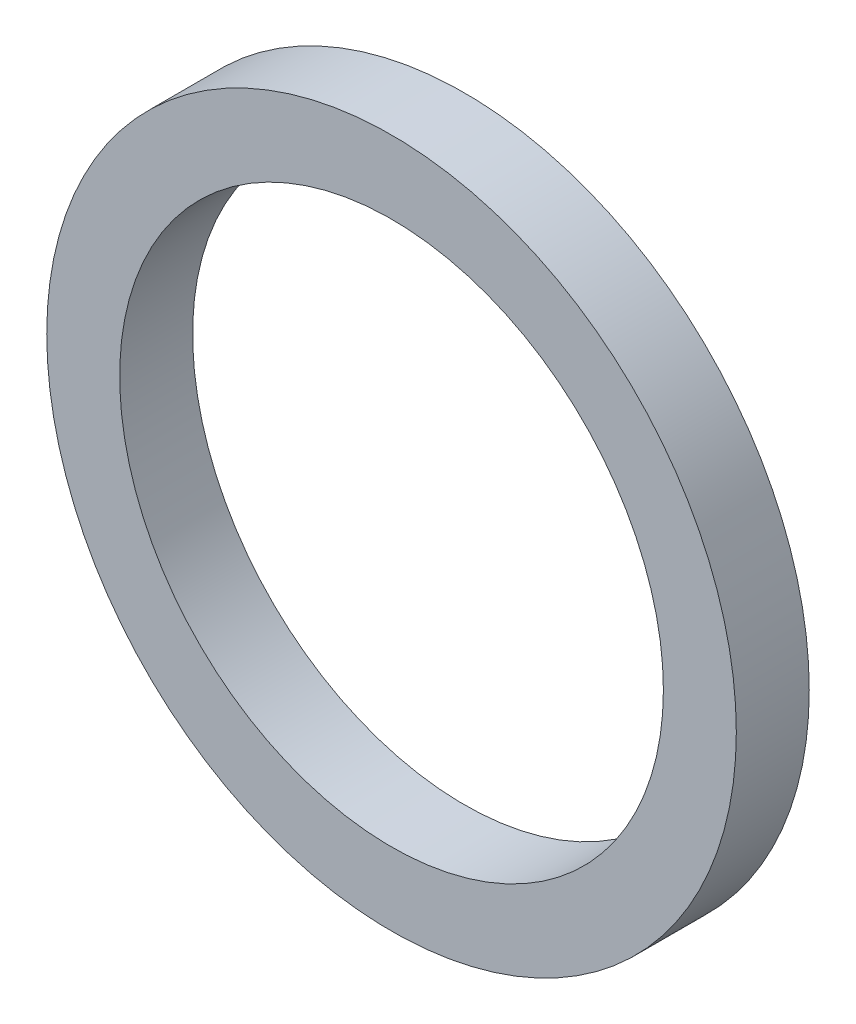
ISO-10303-21;
HEADER;
FILE_DESCRIPTION(('STEP AP214'),'2;1');
FILE_NAME('part.step','',(''),(''),'','','');
FILE_SCHEMA(('AUTOMOTIVE_DESIGN { 1 0 10303 214 1 1 1 1 }'));
ENDSEC;
DATA;
#1=APPLICATION_CONTEXT('core data for automotive mechanical design processes');
#2=APPLICATION_PROTOCOL_DEFINITION('international standard','automotive_design',2000,#1);
#3=PRODUCT_CONTEXT('',#1,'mechanical');
#4=PRODUCT('Part','Part','',(#3));
#5=PRODUCT_RELATED_PRODUCT_CATEGORY('part','',(#4));
#6=PRODUCT_DEFINITION_FORMATION('','',#4);
#7=PRODUCT_DEFINITION_CONTEXT('part definition',#1,'design');
#8=PRODUCT_DEFINITION('design','',#6,#7);
#9=PRODUCT_DEFINITION_SHAPE('','',#8);
#10=(LENGTH_UNIT() NAMED_UNIT(*) SI_UNIT(.MILLI.,.METRE.));
#11=(NAMED_UNIT(*) PLANE_ANGLE_UNIT() SI_UNIT($,.RADIAN.));
#12=(NAMED_UNIT(*) SI_UNIT($,.STERADIAN.) SOLID_ANGLE_UNIT());
#13=UNCERTAINTY_MEASURE_WITH_UNIT(LENGTH_MEASURE(1.E-05),#10,'distance_accuracy_value','');
#14=(GEOMETRIC_REPRESENTATION_CONTEXT(3) GLOBAL_UNCERTAINTY_ASSIGNED_CONTEXT((#13)) GLOBAL_UNIT_ASSIGNED_CONTEXT((#10,
#11,#12)) REPRESENTATION_CONTEXT('',''));
#15=CARTESIAN_POINT('',(0.,0.,0.));
#16=DIRECTION('',(0.,0.,1.));
#17=DIRECTION('',(1.,0.,0.));
#18=AXIS2_PLACEMENT_3D('',#15,#16,#17);
#19=CARTESIAN_POINT('',(0.,0.,1.1));
#20=DIRECTION('',(0.,0.,1.));
#21=DIRECTION('',(1.,0.,0.));
#22=AXIS2_PLACEMENT_3D('',#19,#20,#21);
#23=PLANE('',#22);
#24=CARTESIAN_POINT('',(0.,0.,1.1));
#25=DIRECTION('',(0.,0.,1.));
#26=DIRECTION('',(1.,0.,0.));
#27=AXIS2_PLACEMENT_3D('',#24,#25,#26);
#28=CIRCLE('',#27,5.2);
#29=CARTESIAN_POINT('',(5.2,0.,1.1));
#30=VERTEX_POINT('',#29);
#31=EDGE_CURVE('E10',#30,#30,#28,.T.);
#32=ORIENTED_EDGE('',*,*,#31,.T.);
#33=EDGE_LOOP('',(#32));
#34=FACE_BOUND('',#33,.T.);
#35=CARTESIAN_POINT('',(0.,0.,1.1));
#36=DIRECTION('',(0.,0.,1.));
#37=DIRECTION('',(1.,0.,0.));
#38=AXIS2_PLACEMENT_3D('',#35,#36,#37);
#39=CIRCLE('',#38,4.1);
#40=CARTESIAN_POINT('',(4.1,0.,1.1));
#41=VERTEX_POINT('',#40);
#42=EDGE_CURVE('E46',#41,#41,#39,.T.);
#43=ORIENTED_EDGE('',*,*,#42,.F.);
#44=EDGE_LOOP('',(#43));
#45=FACE_BOUND('',#44,.T.);
#46=ADVANCED_FACE('F35',(#34,#45),#23,.T.);
#47=CARTESIAN_POINT('',(0.,0.,0.));
#48=DIRECTION('',(0.,0.,1.));
#49=DIRECTION('',(1.,0.,0.));
#50=AXIS2_PLACEMENT_3D('',#47,#48,#49);
#51=PLANE('',#50);
#52=CARTESIAN_POINT('',(0.,0.,0.));
#53=DIRECTION('',(0.,0.,1.));
#54=DIRECTION('',(1.,0.,0.));
#55=AXIS2_PLACEMENT_3D('',#52,#53,#54);
#56=CIRCLE('',#55,5.2);
#57=CARTESIAN_POINT('',(5.2,0.,0.));
#58=VERTEX_POINT('',#57);
#59=EDGE_CURVE('E39',#58,#58,#56,.T.);
#60=ORIENTED_EDGE('',*,*,#59,.F.);
#61=EDGE_LOOP('',(#60));
#62=FACE_BOUND('',#61,.T.);
#63=CARTESIAN_POINT('',(0.,0.,0.));
#64=DIRECTION('',(0.,0.,1.));
#65=DIRECTION('',(1.,0.,0.));
#66=AXIS2_PLACEMENT_3D('',#63,#64,#65);
#67=CIRCLE('',#66,4.1);
#68=CARTESIAN_POINT('',(4.1,0.,0.));
#69=VERTEX_POINT('',#68);
#70=EDGE_CURVE('E48',#69,#69,#67,.T.);
#71=ORIENTED_EDGE('',*,*,#70,.T.);
#72=EDGE_LOOP('',(#71));
#73=FACE_BOUND('',#72,.T.);
#74=ADVANCED_FACE('F58',(#62,#73),#51,.F.);
#75=CARTESIAN_POINT('',(0.,0.,1.1));
#76=DIRECTION('',(0.,0.,-1.));
#77=DIRECTION('',(-1.,0.,0.));
#78=AXIS2_PLACEMENT_3D('',#75,#76,#77);
#79=CYLINDRICAL_SURFACE('',#78,5.2);
#80=ORIENTED_EDGE('',*,*,#31,.F.);
#81=EDGE_LOOP('',(#80));
#82=FACE_BOUND('',#81,.T.);
#83=ORIENTED_EDGE('',*,*,#59,.T.);
#84=EDGE_LOOP('',(#83));
#85=FACE_BOUND('',#84,.T.);
#86=ADVANCED_FACE('F37',(#82,#85),#79,.T.);
#87=CARTESIAN_POINT('',(0.,0.,1.1));
#88=DIRECTION('',(0.,0.,-1.));
#89=DIRECTION('',(-1.,0.,0.));
#90=AXIS2_PLACEMENT_3D('',#87,#88,#89);
#91=CYLINDRICAL_SURFACE('',#90,4.1);
#92=ORIENTED_EDGE('',*,*,#42,.T.);
#93=EDGE_LOOP('',(#92));
#94=FACE_BOUND('',#93,.T.);
#95=ORIENTED_EDGE('',*,*,#70,.F.);
#96=EDGE_LOOP('',(#95));
#97=FACE_BOUND('',#96,.T.);
#98=ADVANCED_FACE('F54',(#94,#97),#91,.F.);
#99=CLOSED_SHELL('',(#46,#74,#86,#98));
#100=MANIFOLD_SOLID_BREP('B2',#99);
#101=ADVANCED_BREP_SHAPE_REPRESENTATION('',(#18,#100),#14);
#102=SHAPE_DEFINITION_REPRESENTATION(#9,#101);
ENDSEC;
END-ISO-10303-21;
